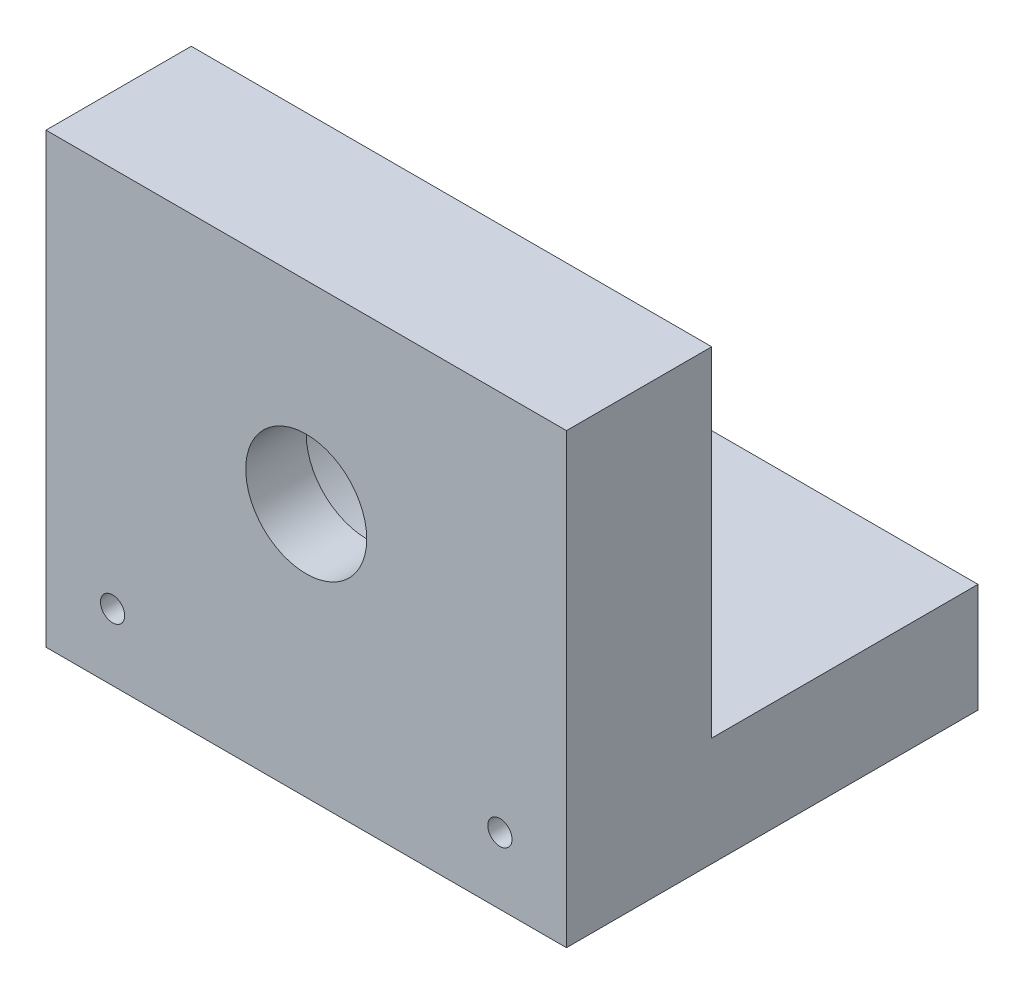
ISO-10303-21;
HEADER;
FILE_DESCRIPTION(('STEP AP214'),'2;1');
FILE_NAME('part.step','',(''),(''),'','','');
FILE_SCHEMA(('AUTOMOTIVE_DESIGN { 1 0 10303 214 1 1 1 1 }'));
ENDSEC;
DATA;
#1=APPLICATION_CONTEXT('core data for automotive mechanical design processes');
#2=APPLICATION_PROTOCOL_DEFINITION('international standard','automotive_design',2000,#1);
#3=PRODUCT_CONTEXT('',#1,'mechanical');
#4=PRODUCT('Part','Part','',(#3));
#5=PRODUCT_RELATED_PRODUCT_CATEGORY('part','',(#4));
#6=PRODUCT_DEFINITION_FORMATION('','',#4);
#7=PRODUCT_DEFINITION_CONTEXT('part definition',#1,'design');
#8=PRODUCT_DEFINITION('design','',#6,#7);
#9=PRODUCT_DEFINITION_SHAPE('','',#8);
#10=(LENGTH_UNIT() NAMED_UNIT(*) SI_UNIT(.MILLI.,.METRE.));
#11=(NAMED_UNIT(*) PLANE_ANGLE_UNIT() SI_UNIT($,.RADIAN.));
#12=(NAMED_UNIT(*) SI_UNIT($,.STERADIAN.) SOLID_ANGLE_UNIT());
#13=UNCERTAINTY_MEASURE_WITH_UNIT(LENGTH_MEASURE(1.E-05),#10,'distance_accuracy_value','');
#14=(GEOMETRIC_REPRESENTATION_CONTEXT(3) GLOBAL_UNCERTAINTY_ASSIGNED_CONTEXT((#13)) GLOBAL_UNIT_ASSIGNED_CONTEXT((#10,
#11,#12)) REPRESENTATION_CONTEXT('',''));
#15=CARTESIAN_POINT('',(0.,0.,0.));
#16=DIRECTION('',(0.,0.,1.));
#17=DIRECTION('',(1.,0.,0.));
#18=AXIS2_PLACEMENT_3D('',#15,#16,#17);
#19=CARTESIAN_POINT('',(0.,0.,-12.));
#20=DIRECTION('',(0.,0.,-1.));
#21=DIRECTION('',(-1.,0.,0.));
#22=AXIS2_PLACEMENT_3D('',#19,#20,#21);
#23=PLANE('',#22);
#24=CARTESIAN_POINT('',(21.5,21.,-12.));
#25=DIRECTION('',(0.,0.,-1.));
#26=DIRECTION('',(-1.,0.,0.));
#27=AXIS2_PLACEMENT_3D('',#24,#25,#26);
#28=CIRCLE('',#27,11.);
#29=CARTESIAN_POINT('',(10.5,21.,-12.));
#30=VERTEX_POINT('',#29);
#31=EDGE_CURVE('E167',#30,#30,#28,.T.);
#32=ORIENTED_EDGE('',*,*,#31,.F.);
#33=EDGE_LOOP('',(#32));
#34=FACE_BOUND('',#33,.T.);
#35=DIRECTION('',(0.,1.,0.));
#36=VECTOR('',#35,1.);
#37=CARTESIAN_POINT('',(43.,0.,-12.));
#38=LINE('',#37,#36);
#39=CARTESIAN_POINT('',(43.,9.,-12.));
#40=VERTEX_POINT('',#39);
#41=CARTESIAN_POINT('',(43.,37.,-12.));
#42=VERTEX_POINT('',#41);
#43=EDGE_CURVE('E103',#40,#42,#38,.T.);
#44=ORIENTED_EDGE('',*,*,#43,.F.);
#45=DIRECTION('',(-1.,0.,0.));
#46=VECTOR('',#45,1.);
#47=CARTESIAN_POINT('',(0.,9.,-12.));
#48=LINE('',#47,#46);
#49=CARTESIAN_POINT('',(0.,9.,-12.));
#50=VERTEX_POINT('',#49);
#51=EDGE_CURVE('E134',#40,#50,#48,.T.);
#52=ORIENTED_EDGE('',*,*,#51,.T.);
#53=DIRECTION('',(0.,-1.,0.));
#54=VECTOR('',#53,1.);
#55=CARTESIAN_POINT('',(0.,0.,-12.));
#56=LINE('',#55,#54);
#57=CARTESIAN_POINT('',(0.,37.,-12.));
#58=VERTEX_POINT('',#57);
#59=EDGE_CURVE('E99',#58,#50,#56,.T.);
#60=ORIENTED_EDGE('',*,*,#59,.F.);
#61=DIRECTION('',(-1.,0.,0.));
#62=VECTOR('',#61,1.);
#63=CARTESIAN_POINT('',(0.,37.,-12.));
#64=LINE('',#63,#62);
#65=EDGE_CURVE('E86',#42,#58,#64,.T.);
#66=ORIENTED_EDGE('',*,*,#65,.F.);
#67=EDGE_LOOP('',(#44,#52,#60,#66));
#68=FACE_BOUND('',#67,.T.);
#69=ADVANCED_FACE('F40',(#34,#68),#23,.T.);
#70=CARTESIAN_POINT('',(21.5,21.,-12.));
#71=DIRECTION('',(0.,0.,1.));
#72=DIRECTION('',(1.,0.,0.));
#73=AXIS2_PLACEMENT_3D('',#70,#71,#72);
#74=CYLINDRICAL_SURFACE('',#73,5.);
#75=CARTESIAN_POINT('',(21.5,21.,0.));
#76=DIRECTION('',(0.,0.,1.));
#77=DIRECTION('',(1.,0.,0.));
#78=AXIS2_PLACEMENT_3D('',#75,#76,#77);
#79=CIRCLE('',#78,5.);
#80=CARTESIAN_POINT('',(26.5,21.,0.));
#81=VERTEX_POINT('',#80);
#82=EDGE_CURVE('E94',#81,#81,#79,.T.);
#83=ORIENTED_EDGE('',*,*,#82,.T.);
#84=EDGE_LOOP('',(#83));
#85=FACE_BOUND('',#84,.T.);
#86=CARTESIAN_POINT('',(21.5,21.,-5.));
#87=DIRECTION('',(0.,0.,-1.));
#88=DIRECTION('',(-1.,0.,0.));
#89=AXIS2_PLACEMENT_3D('',#86,#87,#88);
#90=CIRCLE('',#89,5.);
#91=CARTESIAN_POINT('',(16.5,21.,-5.));
#92=VERTEX_POINT('',#91);
#93=EDGE_CURVE('E44',#92,#92,#90,.F.);
#94=ORIENTED_EDGE('',*,*,#93,.F.);
#95=EDGE_LOOP('',(#94));
#96=FACE_BOUND('',#95,.T.);
#97=ADVANCED_FACE('F181',(#85,#96),#74,.F.);
#98=CARTESIAN_POINT('',(0.,0.,-12.));
#99=DIRECTION('',(-1.,0.,0.));
#100=DIRECTION('',(0.,0.,1.));
#101=AXIS2_PLACEMENT_3D('',#98,#99,#100);
#102=PLANE('',#101);
#103=DIRECTION('',(0.,0.,1.));
#104=VECTOR('',#103,1.);
#105=CARTESIAN_POINT('',(0.,0.,-12.));
#106=LINE('',#105,#104);
#107=CARTESIAN_POINT('',(0.,0.,-34.));
#108=VERTEX_POINT('',#107);
#109=CARTESIAN_POINT('',(0.,0.,0.));
#110=VERTEX_POINT('',#109);
#111=EDGE_CURVE('E91',#108,#110,#106,.T.);
#112=ORIENTED_EDGE('',*,*,#111,.T.);
#113=DIRECTION('',(0.,-1.,0.));
#114=VECTOR('',#113,1.);
#115=CARTESIAN_POINT('',(0.,0.,0.));
#116=LINE('',#115,#114);
#117=CARTESIAN_POINT('',(0.,37.,0.));
#118=VERTEX_POINT('',#117);
#119=EDGE_CURVE('E88',#118,#110,#116,.T.);
#120=ORIENTED_EDGE('',*,*,#119,.F.);
#121=DIRECTION('',(0.,0.,1.));
#122=VECTOR('',#121,1.);
#123=CARTESIAN_POINT('',(0.,37.,-12.));
#124=LINE('',#123,#122);
#125=EDGE_CURVE('E11',#58,#118,#124,.T.);
#126=ORIENTED_EDGE('',*,*,#125,.F.);
#127=ORIENTED_EDGE('',*,*,#59,.T.);
#128=DIRECTION('',(0.,0.,-1.));
#129=VECTOR('',#128,1.);
#130=CARTESIAN_POINT('',(0.,9.,0.));
#131=LINE('',#130,#129);
#132=CARTESIAN_POINT('',(0.,9.,-34.));
#133=VERTEX_POINT('',#132);
#134=EDGE_CURVE('E138',#50,#133,#131,.T.);
#135=ORIENTED_EDGE('',*,*,#134,.T.);
#136=DIRECTION('',(0.,-1.,0.));
#137=VECTOR('',#136,1.);
#138=CARTESIAN_POINT('',(0.,9.,-34.));
#139=LINE('',#138,#137);
#140=EDGE_CURVE('E153',#133,#108,#139,.T.);
#141=ORIENTED_EDGE('',*,*,#140,.T.);
#142=EDGE_LOOP('',(#112,#120,#126,#127,#135,#141));
#143=FACE_BOUND('',#142,.T.);
#144=ADVANCED_FACE('F42',(#143),#102,.T.);
#145=CARTESIAN_POINT('',(0.,37.,-12.));
#146=DIRECTION('',(0.,1.,0.));
#147=DIRECTION('',(0.,0.,1.));
#148=AXIS2_PLACEMENT_3D('',#145,#146,#147);
#149=PLANE('',#148);
#150=DIRECTION('',(-1.,0.,0.));
#151=VECTOR('',#150,1.);
#152=CARTESIAN_POINT('',(0.,37.,0.));
#153=LINE('',#152,#151);
#154=CARTESIAN_POINT('',(43.,37.,0.));
#155=VERTEX_POINT('',#154);
#156=EDGE_CURVE('E84',#155,#118,#153,.T.);
#157=ORIENTED_EDGE('',*,*,#156,.F.);
#158=DIRECTION('',(0.,0.,1.));
#159=VECTOR('',#158,1.);
#160=CARTESIAN_POINT('',(43.,37.,-12.));
#161=LINE('',#160,#159);
#162=EDGE_CURVE('E50',#42,#155,#161,.T.);
#163=ORIENTED_EDGE('',*,*,#162,.F.);
#164=ORIENTED_EDGE('',*,*,#65,.T.);
#165=ORIENTED_EDGE('',*,*,#125,.T.);
#166=EDGE_LOOP('',(#157,#163,#164,#165));
#167=FACE_BOUND('',#166,.T.);
#168=ADVANCED_FACE('F82',(#167),#149,.T.);
#169=CARTESIAN_POINT('',(43.,0.,-12.));
#170=DIRECTION('',(1.,0.,0.));
#171=DIRECTION('',(0.,0.,-1.));
#172=AXIS2_PLACEMENT_3D('',#169,#170,#171);
#173=PLANE('',#172);
#174=DIRECTION('',(0.,0.,1.));
#175=VECTOR('',#174,1.);
#176=CARTESIAN_POINT('',(43.,9.,0.));
#177=LINE('',#176,#175);
#178=CARTESIAN_POINT('',(43.,9.,-34.));
#179=VERTEX_POINT('',#178);
#180=EDGE_CURVE('E150',#179,#40,#177,.T.);
#181=ORIENTED_EDGE('',*,*,#180,.T.);
#182=ORIENTED_EDGE('',*,*,#43,.T.);
#183=ORIENTED_EDGE('',*,*,#162,.T.);
#184=DIRECTION('',(0.,1.,0.));
#185=VECTOR('',#184,1.);
#186=CARTESIAN_POINT('',(43.,0.,0.));
#187=LINE('',#186,#185);
#188=CARTESIAN_POINT('',(43.,0.,0.));
#189=VERTEX_POINT('',#188);
#190=EDGE_CURVE('E77',#189,#155,#187,.T.);
#191=ORIENTED_EDGE('',*,*,#190,.F.);
#192=DIRECTION('',(0.,0.,1.));
#193=VECTOR('',#192,1.);
#194=CARTESIAN_POINT('',(43.,0.,-12.));
#195=LINE('',#194,#193);
#196=CARTESIAN_POINT('',(43.,0.,-34.));
#197=VERTEX_POINT('',#196);
#198=EDGE_CURVE('E109',#197,#189,#195,.T.);
#199=ORIENTED_EDGE('',*,*,#198,.F.);
#200=DIRECTION('',(0.,-1.,0.));
#201=VECTOR('',#200,1.);
#202=CARTESIAN_POINT('',(43.,9.,-34.));
#203=LINE('',#202,#201);
#204=EDGE_CURVE('E148',#179,#197,#203,.T.);
#205=ORIENTED_EDGE('',*,*,#204,.F.);
#206=EDGE_LOOP('',(#181,#182,#183,#191,#199,#205));
#207=FACE_BOUND('',#206,.T.);
#208=ADVANCED_FACE('F128',(#207),#173,.T.);
#209=CARTESIAN_POINT('',(0.,0.,-12.));
#210=DIRECTION('',(0.,-1.,0.));
#211=DIRECTION('',(0.,0.,-1.));
#212=AXIS2_PLACEMENT_3D('',#209,#210,#211);
#213=PLANE('',#212);
#214=DIRECTION('',(1.,0.,0.));
#215=VECTOR('',#214,1.);
#216=CARTESIAN_POINT('',(0.,0.,0.));
#217=LINE('',#216,#215);
#218=EDGE_CURVE('E93',#110,#189,#217,.T.);
#219=ORIENTED_EDGE('',*,*,#218,.F.);
#220=ORIENTED_EDGE('',*,*,#111,.F.);
#221=DIRECTION('',(1.,0.,0.));
#222=VECTOR('',#221,1.);
#223=CARTESIAN_POINT('',(0.,0.,-34.));
#224=LINE('',#223,#222);
#225=EDGE_CURVE('E123',#108,#197,#224,.T.);
#226=ORIENTED_EDGE('',*,*,#225,.T.);
#227=ORIENTED_EDGE('',*,*,#198,.T.);
#228=EDGE_LOOP('',(#219,#220,#226,#227));
#229=FACE_BOUND('',#228,.T.);
#230=ADVANCED_FACE('F117',(#229),#213,.T.);
#231=CARTESIAN_POINT('',(0.,0.,0.));
#232=DIRECTION('',(0.,0.,-1.));
#233=DIRECTION('',(-1.,0.,0.));
#234=AXIS2_PLACEMENT_3D('',#231,#232,#233);
#235=PLANE('',#234);
#236=CARTESIAN_POINT('',(5.5,5.5,0.));
#237=DIRECTION('',(0.,0.,1.));
#238=DIRECTION('',(1.,0.,0.));
#239=AXIS2_PLACEMENT_3D('',#236,#237,#238);
#240=CIRCLE('',#239,1.);
#241=CARTESIAN_POINT('',(6.5,5.5,0.));
#242=VERTEX_POINT('',#241);
#243=EDGE_CURVE('E326',#242,#242,#240,.T.);
#244=ORIENTED_EDGE('',*,*,#243,.F.);
#245=EDGE_LOOP('',(#244));
#246=FACE_BOUND('',#245,.T.);
#247=CARTESIAN_POINT('',(37.5,5.5,0.));
#248=DIRECTION('',(0.,0.,1.));
#249=DIRECTION('',(1.,0.,0.));
#250=AXIS2_PLACEMENT_3D('',#247,#248,#249);
#251=CIRCLE('',#250,0.999999999999998);
#252=CARTESIAN_POINT('',(38.5,5.5,0.));
#253=VERTEX_POINT('',#252);
#254=EDGE_CURVE('E333',#253,#253,#251,.T.);
#255=ORIENTED_EDGE('',*,*,#254,.F.);
#256=EDGE_LOOP('',(#255));
#257=FACE_BOUND('',#256,.T.);
#258=ORIENTED_EDGE('',*,*,#190,.T.);
#259=ORIENTED_EDGE('',*,*,#156,.T.);
#260=ORIENTED_EDGE('',*,*,#119,.T.);
#261=ORIENTED_EDGE('',*,*,#218,.T.);
#262=EDGE_LOOP('',(#258,#259,#260,#261));
#263=FACE_BOUND('',#262,.T.);
#264=ORIENTED_EDGE('',*,*,#82,.F.);
#265=EDGE_LOOP('',(#264));
#266=FACE_BOUND('',#265,.T.);
#267=ADVANCED_FACE('F96',(#246,#257,#263,#266),#235,.F.);
#268=CARTESIAN_POINT('',(21.5,21.,-5.));
#269=DIRECTION('',(0.,0.,-1.));
#270=DIRECTION('',(-1.,0.,0.));
#271=AXIS2_PLACEMENT_3D('',#268,#269,#270);
#272=PLANE('',#271);
#273=CARTESIAN_POINT('',(21.5,21.,-5.));
#274=DIRECTION('',(0.,0.,-1.));
#275=DIRECTION('',(-1.,0.,0.));
#276=AXIS2_PLACEMENT_3D('',#273,#274,#275);
#277=CIRCLE('',#276,11.);
#278=CARTESIAN_POINT('',(10.5,21.,-5.));
#279=VERTEX_POINT('',#278);
#280=EDGE_CURVE('E168',#279,#279,#277,.T.);
#281=ORIENTED_EDGE('',*,*,#280,.T.);
#282=EDGE_LOOP('',(#281));
#283=FACE_BOUND('',#282,.T.);
#284=ORIENTED_EDGE('',*,*,#93,.T.);
#285=EDGE_LOOP('',(#284));
#286=FACE_BOUND('',#285,.T.);
#287=ADVANCED_FACE('F179',(#283,#286),#272,.T.);
#288=CARTESIAN_POINT('',(21.5,21.,-5.));
#289=DIRECTION('',(0.,0.,-1.));
#290=DIRECTION('',(-1.,0.,0.));
#291=AXIS2_PLACEMENT_3D('',#288,#289,#290);
#292=CYLINDRICAL_SURFACE('',#291,11.);
#293=ORIENTED_EDGE('',*,*,#280,.F.);
#294=EDGE_LOOP('',(#293));
#295=FACE_BOUND('',#294,.T.);
#296=ORIENTED_EDGE('',*,*,#31,.T.);
#297=EDGE_LOOP('',(#296));
#298=FACE_BOUND('',#297,.T.);
#299=ADVANCED_FACE('F191',(#295,#298),#292,.F.);
#300=CARTESIAN_POINT('',(0.,9.,-34.));
#301=DIRECTION('',(0.,0.,-1.));
#302=DIRECTION('',(-1.,0.,0.));
#303=AXIS2_PLACEMENT_3D('',#300,#301,#302);
#304=PLANE('',#303);
#305=ORIENTED_EDGE('',*,*,#225,.F.);
#306=ORIENTED_EDGE('',*,*,#140,.F.);
#307=DIRECTION('',(1.,0.,0.));
#308=VECTOR('',#307,1.);
#309=CARTESIAN_POINT('',(0.,9.,-34.));
#310=LINE('',#309,#308);
#311=EDGE_CURVE('E156',#133,#179,#310,.T.);
#312=ORIENTED_EDGE('',*,*,#311,.T.);
#313=ORIENTED_EDGE('',*,*,#204,.T.);
#314=EDGE_LOOP('',(#305,#306,#312,#313));
#315=FACE_BOUND('',#314,.T.);
#316=ADVANCED_FACE('F158',(#315),#304,.T.);
#317=CARTESIAN_POINT('',(0.,9.,0.));
#318=DIRECTION('',(0.,-1.,0.));
#319=DIRECTION('',(0.,0.,-1.));
#320=AXIS2_PLACEMENT_3D('',#317,#318,#319);
#321=PLANE('',#320);
#322=ORIENTED_EDGE('',*,*,#51,.F.);
#323=ORIENTED_EDGE('',*,*,#180,.F.);
#324=ORIENTED_EDGE('',*,*,#311,.F.);
#325=ORIENTED_EDGE('',*,*,#134,.F.);
#326=EDGE_LOOP('',(#322,#323,#324,#325));
#327=FACE_BOUND('',#326,.T.);
#328=ADVANCED_FACE('F155',(#327),#321,.F.);
#329=CARTESIAN_POINT('',(37.5,5.5,-10.));
#330=DIRECTION('',(0.,0.,1.));
#331=DIRECTION('',(1.,0.,0.));
#332=AXIS2_PLACEMENT_3D('',#329,#330,#331);
#333=CYLINDRICAL_SURFACE('',#332,0.999999999999998);
#334=CARTESIAN_POINT('',(37.5,5.5,-10.));
#335=DIRECTION('',(0.,0.,1.));
#336=DIRECTION('',(1.,0.,0.));
#337=AXIS2_PLACEMENT_3D('',#334,#335,#336);
#338=CIRCLE('',#337,0.999999999999998);
#339=CARTESIAN_POINT('',(38.5,5.5,-10.));
#340=VERTEX_POINT('',#339);
#341=EDGE_CURVE('E329',#340,#340,#338,.T.);
#342=ORIENTED_EDGE('',*,*,#341,.F.);
#343=EDGE_LOOP('',(#342));
#344=FACE_BOUND('',#343,.T.);
#345=ORIENTED_EDGE('',*,*,#254,.T.);
#346=EDGE_LOOP('',(#345));
#347=FACE_BOUND('',#346,.T.);
#348=ADVANCED_FACE('F236',(#344,#347),#333,.F.);
#349=CARTESIAN_POINT('',(37.5,5.5,-10.));
#350=DIRECTION('',(0.,0.,1.));
#351=DIRECTION('',(1.,0.,0.));
#352=AXIS2_PLACEMENT_3D('',#349,#350,#351);
#353=PLANE('',#352);
#354=ORIENTED_EDGE('',*,*,#341,.T.);
#355=EDGE_LOOP('',(#354));
#356=FACE_BOUND('',#355,.T.);
#357=ADVANCED_FACE('F242',(#356),#353,.T.);
#358=CARTESIAN_POINT('',(5.5,5.5,-10.));
#359=DIRECTION('',(0.,0.,1.));
#360=DIRECTION('',(1.,0.,0.));
#361=AXIS2_PLACEMENT_3D('',#358,#359,#360);
#362=CYLINDRICAL_SURFACE('',#361,1.);
#363=CARTESIAN_POINT('',(5.5,5.5,-10.));
#364=DIRECTION('',(0.,0.,1.));
#365=DIRECTION('',(1.,0.,0.));
#366=AXIS2_PLACEMENT_3D('',#363,#364,#365);
#367=CIRCLE('',#366,1.);
#368=CARTESIAN_POINT('',(6.5,5.5,-10.));
#369=VERTEX_POINT('',#368);
#370=EDGE_CURVE('E163',#369,#369,#367,.T.);
#371=ORIENTED_EDGE('',*,*,#370,.F.);
#372=EDGE_LOOP('',(#371));
#373=FACE_BOUND('',#372,.T.);
#374=ORIENTED_EDGE('',*,*,#243,.T.);
#375=EDGE_LOOP('',(#374));
#376=FACE_BOUND('',#375,.T.);
#377=ADVANCED_FACE('F250',(#373,#376),#362,.F.);
#378=CARTESIAN_POINT('',(5.5,5.5,-10.));
#379=DIRECTION('',(0.,0.,1.));
#380=DIRECTION('',(1.,0.,0.));
#381=AXIS2_PLACEMENT_3D('',#378,#379,#380);
#382=PLANE('',#381);
#383=ORIENTED_EDGE('',*,*,#370,.T.);
#384=EDGE_LOOP('',(#383));
#385=FACE_BOUND('',#384,.T.);
#386=ADVANCED_FACE('F258',(#385),#382,.T.);
#387=CLOSED_SHELL('',(#69,#97,#144,#168,#208,#230,#267,#287,#299,#316,#328,#348,#357,#377,#386));
#388=MANIFOLD_SOLID_BREP('B2',#387);
#389=ADVANCED_BREP_SHAPE_REPRESENTATION('',(#18,#388),#14);
#390=SHAPE_DEFINITION_REPRESENTATION(#9,#389);
ENDSEC;
END-ISO-10303-21;
